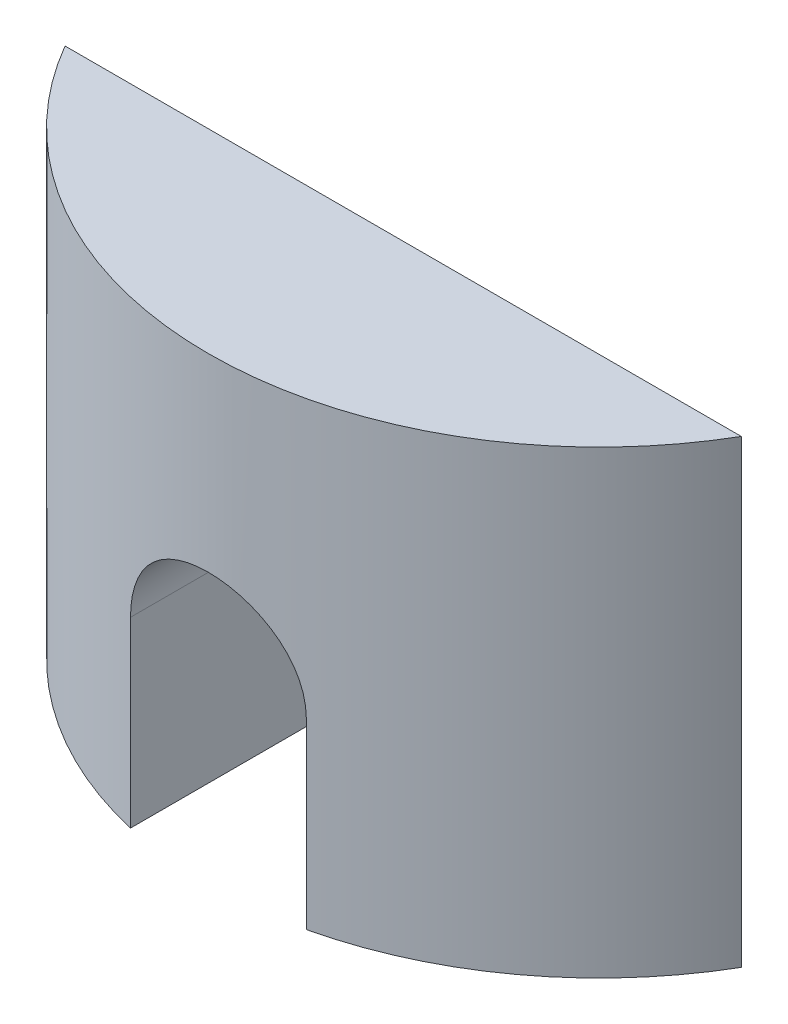
ISO-10303-21;
HEADER;
FILE_DESCRIPTION(('STEP AP214'),'2;1');
FILE_NAME('part.step','',(''),(''),'','','');
FILE_SCHEMA(('AUTOMOTIVE_DESIGN { 1 0 10303 214 1 1 1 1 }'));
ENDSEC;
DATA;
#1=APPLICATION_CONTEXT('core data for automotive mechanical design processes');
#2=APPLICATION_PROTOCOL_DEFINITION('international standard','automotive_design',2000,#1);
#3=PRODUCT_CONTEXT('',#1,'mechanical');
#4=PRODUCT('Part','Part','',(#3));
#5=PRODUCT_RELATED_PRODUCT_CATEGORY('part','',(#4));
#6=PRODUCT_DEFINITION_FORMATION('','',#4);
#7=PRODUCT_DEFINITION_CONTEXT('part definition',#1,'design');
#8=PRODUCT_DEFINITION('design','',#6,#7);
#9=PRODUCT_DEFINITION_SHAPE('','',#8);
#10=(LENGTH_UNIT() NAMED_UNIT(*) SI_UNIT(.MILLI.,.METRE.));
#11=(NAMED_UNIT(*) PLANE_ANGLE_UNIT() SI_UNIT($,.RADIAN.));
#12=(NAMED_UNIT(*) SI_UNIT($,.STERADIAN.) SOLID_ANGLE_UNIT());
#13=UNCERTAINTY_MEASURE_WITH_UNIT(LENGTH_MEASURE(1.E-05),#10,'distance_accuracy_value','');
#14=(GEOMETRIC_REPRESENTATION_CONTEXT(3) GLOBAL_UNCERTAINTY_ASSIGNED_CONTEXT((#13)) GLOBAL_UNIT_ASSIGNED_CONTEXT((#10,
#11,#12)) REPRESENTATION_CONTEXT('',''));
#15=CARTESIAN_POINT('',(0.,0.,0.));
#16=DIRECTION('',(0.,0.,1.));
#17=DIRECTION('',(1.,0.,0.));
#18=AXIS2_PLACEMENT_3D('',#15,#16,#17);
#19=CARTESIAN_POINT('',(12.5,0.,-7.25069444444444));
#20=DIRECTION('',(0.,1.,0.));
#21=DIRECTION('',(0.,0.,1.));
#22=AXIS2_PLACEMENT_3D('',#19,#20,#21);
#23=PLANE('',#22);
#24=CARTESIAN_POINT('',(12.5,0.,-7.25069444444444));
#25=DIRECTION('',(0.,1.,0.));
#26=DIRECTION('',(0.,0.,1.));
#27=AXIS2_PLACEMENT_3D('',#24,#25,#26);
#28=CIRCLE('',#27,14.4506944444444);
#29=CARTESIAN_POINT('',(15.75,0.,6.82979098492544));
#30=VERTEX_POINT('',#29);
#31=CARTESIAN_POINT('',(25.,0.,0.));
#32=VERTEX_POINT('',#31);
#33=EDGE_CURVE('E90',#30,#32,#28,.T.);
#34=ORIENTED_EDGE('',*,*,#33,.F.);
#35=DIRECTION('',(0.,0.,-1.));
#36=VECTOR('',#35,1.);
#37=CARTESIAN_POINT('',(15.75,0.,7.201));
#38=LINE('',#37,#36);
#39=CARTESIAN_POINT('',(15.75,0.,0.));
#40=VERTEX_POINT('',#39);
#41=EDGE_CURVE('E99',#30,#40,#38,.T.);
#42=ORIENTED_EDGE('',*,*,#41,.T.);
#43=DIRECTION('',(-1.,0.,0.));
#44=VECTOR('',#43,1.);
#45=CARTESIAN_POINT('',(0.,0.,0.));
#46=LINE('',#45,#44);
#47=EDGE_CURVE('E80',#32,#40,#46,.T.);
#48=ORIENTED_EDGE('',*,*,#47,.F.);
#49=EDGE_LOOP('',(#34,#42,#48));
#50=FACE_BOUND('',#49,.T.);
#51=ADVANCED_FACE('F33',(#50),#23,.F.);
#52=CARTESIAN_POINT('',(12.5,17.,-7.25069444444444));
#53=DIRECTION('',(0.,-1.,0.));
#54=DIRECTION('',(0.,0.,-1.));
#55=AXIS2_PLACEMENT_3D('',#52,#53,#54);
#56=CYLINDRICAL_SURFACE('',#55,14.4506944444444);
#57=CARTESIAN_POINT('',(15.75,6.75,6.82979098492544));
#58=CARTESIAN_POINT('',(15.7500100979928,6.84017309929072,6.82978207036309));
#59=CARTESIAN_POINT('',(15.7462472773982,6.9303404244272,6.83065700660543));
#60=CARTESIAN_POINT('',(15.7312541741048,7.11000664068488,6.83410852193391));
#61=CARTESIAN_POINT('',(15.7200249703137,7.19950562649325,6.83668485516431));
#62=CARTESIAN_POINT('',(15.6902033190174,7.37705059598649,6.84346725406096));
#63=CARTESIAN_POINT('',(15.671623676813,7.46509883064236,6.84767048521171));
#64=CARTESIAN_POINT('',(15.6272694650283,7.6392531219731,6.85757503872186));
#65=CARTESIAN_POINT('',(15.6014948337241,7.72535916197958,6.86327637393306));
#66=CARTESIAN_POINT('',(15.5136469912468,7.97986478209514,6.88239244625771));
#67=CARTESIAN_POINT('',(15.4410230271039,8.14461010664962,6.89782573593213));
#68=CARTESIAN_POINT('',(15.2698733950116,8.45952617860219,6.93232154504672));
#69=CARTESIAN_POINT('',(15.1713430290809,8.60969427573169,6.95138472257369));
#70=CARTESIAN_POINT('',(14.9492945344272,8.89393886521739,6.99137082736342));
#71=CARTESIAN_POINT('',(14.8254038283357,9.02772136383919,7.0123185156891));
#72=CARTESIAN_POINT('',(14.5569507574089,9.27279613834617,7.05349840878266));
#73=CARTESIAN_POINT('',(14.4123851542332,9.38408488439834,7.07373050084524));
#74=CARTESIAN_POINT('',(14.1046944451549,9.58218943834519,7.11147038493562));
#75=CARTESIAN_POINT('',(13.941380567115,9.66871887743713,7.12894532578534));
#76=CARTESIAN_POINT('',(13.6020791436951,9.81298762681986,7.1589188571177));
#77=CARTESIAN_POINT('',(13.4260937685535,9.87073185377429,7.17141829736814));
#78=CARTESIAN_POINT('',(13.0695226438725,9.95486225849743,7.18985763333379));
#79=CARTESIAN_POINT('',(12.8890609301621,9.98175073883201,7.19590248704781));
#80=CARTESIAN_POINT('',(12.5260894756099,10.0049780316735,7.20111567100761));
#81=CARTESIAN_POINT('',(12.3435799371317,10.0013198366704,7.20028467484272));
#82=CARTESIAN_POINT('',(11.9851689572492,9.96392821389634,7.19191934910496));
#83=CARTESIAN_POINT('',(11.8092077035239,9.9307370675749,7.18450589126792));
#84=CARTESIAN_POINT('',(11.46542009077,9.83608754718759,7.16394699520302));
#85=CARTESIAN_POINT('',(11.2975940474192,9.77462807717007,7.15080133474098));
#86=CARTESIAN_POINT('',(10.973346020124,9.62471373485294,7.12006227004648));
#87=CARTESIAN_POINT('',(10.8170214492242,9.53605529130319,7.10243550343304));
#88=CARTESIAN_POINT('',(10.5212769523391,9.33441409283312,7.0646639028751));
#89=CARTESIAN_POINT('',(10.381858981819,9.22142852835593,7.04451877819639));
#90=CARTESIAN_POINT('',(10.1206685916861,8.97141250937261,7.00340109750861));
#91=CARTESIAN_POINT('',(9.9993488366139,8.83391017490897,6.98242008109273));
#92=CARTESIAN_POINT('',(9.78137238925789,8.54025155056794,6.94240092176995));
#93=CARTESIAN_POINT('',(9.68472244350541,8.38409017504787,6.92336331118473));
#94=CARTESIAN_POINT('',(9.5186066940396,8.05676132394996,6.88935889223175));
#95=CARTESIAN_POINT('',(9.44924627242268,7.88553874036517,6.87440793150892));
#96=CARTESIAN_POINT('',(9.34051457587506,7.53355738961169,6.85048896465696));
#97=CARTESIAN_POINT('',(9.3010986276714,7.35281325987563,6.84151204851896));
#98=CARTESIAN_POINT('',(9.26818349139339,7.1004713933712,6.83397757600851));
#99=CARTESIAN_POINT('',(9.26136283473718,7.03050009053354,6.8324096427533));
#100=CARTESIAN_POINT('',(9.25227654841525,6.89036331191945,6.83031703505251));
#101=CARTESIAN_POINT('',(9.25000338390582,6.8201983505581,6.82979063488283));
#102=CARTESIAN_POINT('',(9.25,6.75,6.82979098492544));
#103=B_SPLINE_CURVE_WITH_KNOTS('',3,(#57,#58,#59,#60,#61,#62,#63,#64,#65,#66,#67,#68,#69,#70,
#71,#72,#73,#74,#75,#76,#77,#78,#79,#80,#81,#82,#83,#84,#85,#86,#87,#88,#89,#90,#91,#92,#93,#94,
#95,#96,#97,#98,#99,#100,#101,#102),.UNSPECIFIED.,.F.,.F.,(4,2,2,2,2,2,2,2,2,2,2,2,2,2,2,2,2,2,
2,2,2,2,4),(0.,0.270426553228011,0.540814037750032,0.810732536213455,1.08065335030381,
1.62001915147565,2.15948283116701,2.70752846132315,3.25566002690402,3.80989634196911,
4.36403795813023,4.90902465440355,5.45395796194915,5.98908712420517,6.52423703495433,
7.06349425919049,7.60281379607268,8.15392991294972,8.70519658421893,9.25857162749959,
9.81111947689677,10.0219589200619,10.2324487282257),.UNSPECIFIED.);
#104=CARTESIAN_POINT('',(15.75,6.75,6.82979098492544));
#105=VERTEX_POINT('',#104);
#106=CARTESIAN_POINT('',(9.25,6.75,6.82979098492544));
#107=VERTEX_POINT('',#106);
#108=EDGE_CURVE('E119',#105,#107,#103,.T.);
#109=ORIENTED_EDGE('',*,*,#108,.F.);
#110=DIRECTION('',(0.,-1.,0.));
#111=VECTOR('',#110,1.);
#112=CARTESIAN_POINT('',(15.75,17.,6.82979098492544));
#113=LINE('',#112,#111);
#114=EDGE_CURVE('E116',#30,#105,#113,.F.);
#115=ORIENTED_EDGE('',*,*,#114,.F.);
#116=ORIENTED_EDGE('',*,*,#33,.T.);
#117=DIRECTION('',(0.,-1.,0.));
#118=VECTOR('',#117,1.);
#119=CARTESIAN_POINT('',(25.,17.,0.));
#120=LINE('',#119,#118);
#121=CARTESIAN_POINT('',(25.,17.,0.));
#122=VERTEX_POINT('',#121);
#123=EDGE_CURVE('E11',#122,#32,#120,.T.);
#124=ORIENTED_EDGE('',*,*,#123,.F.);
#125=CARTESIAN_POINT('',(12.5,17.,-7.25069444444444));
#126=DIRECTION('',(0.,1.,0.));
#127=DIRECTION('',(0.,0.,1.));
#128=AXIS2_PLACEMENT_3D('',#125,#126,#127);
#129=CIRCLE('',#128,14.4506944444444);
#130=CARTESIAN_POINT('',(0.,17.,0.));
#131=VERTEX_POINT('',#130);
#132=EDGE_CURVE('E87',#131,#122,#129,.T.);
#133=ORIENTED_EDGE('',*,*,#132,.F.);
#134=DIRECTION('',(0.,-1.,0.));
#135=VECTOR('',#134,1.);
#136=CARTESIAN_POINT('',(0.,17.,0.));
#137=LINE('',#136,#135);
#138=CARTESIAN_POINT('',(0.,0.,0.));
#139=VERTEX_POINT('',#138);
#140=EDGE_CURVE('E41',#131,#139,#137,.T.);
#141=ORIENTED_EDGE('',*,*,#140,.T.);
#142=CARTESIAN_POINT('',(9.25,0.,6.82979098492544));
#143=VERTEX_POINT('',#142);
#144=EDGE_CURVE('E81',#139,#143,#28,.T.);
#145=ORIENTED_EDGE('',*,*,#144,.T.);
#146=DIRECTION('',(0.,-1.,0.));
#147=VECTOR('',#146,1.);
#148=CARTESIAN_POINT('',(9.25,17.,6.82979098492544));
#149=LINE('',#148,#147);
#150=EDGE_CURVE('E48',#107,#143,#149,.T.);
#151=ORIENTED_EDGE('',*,*,#150,.F.);
#152=EDGE_LOOP('',(#109,#115,#116,#124,#133,#141,#145,#151));
#153=FACE_BOUND('',#152,.T.);
#154=ADVANCED_FACE('F35',(#153),#56,.T.);
#155=CARTESIAN_POINT('',(0.,17.,0.));
#156=DIRECTION('',(0.,0.,1.));
#157=DIRECTION('',(1.,0.,0.));
#158=AXIS2_PLACEMENT_3D('',#155,#156,#157);
#159=PLANE('',#158);
#160=ORIENTED_EDGE('',*,*,#47,.T.);
#161=DIRECTION('',(0.,-1.,0.));
#162=VECTOR('',#161,1.);
#163=CARTESIAN_POINT('',(15.75,0.,0.));
#164=LINE('',#163,#162);
#165=CARTESIAN_POINT('',(15.75,6.75,0.));
#166=VERTEX_POINT('',#165);
#167=EDGE_CURVE('E102',#166,#40,#164,.T.);
#168=ORIENTED_EDGE('',*,*,#167,.F.);
#169=CARTESIAN_POINT('',(12.5,6.75,0.));
#170=DIRECTION('',(0.,0.,-1.));
#171=DIRECTION('',(-1.,0.,0.));
#172=AXIS2_PLACEMENT_3D('',#169,#170,#171);
#173=CIRCLE('',#172,3.25);
#174=CARTESIAN_POINT('',(9.25,6.75,0.));
#175=VERTEX_POINT('',#174);
#176=EDGE_CURVE('E112',#175,#166,#173,.T.);
#177=ORIENTED_EDGE('',*,*,#176,.F.);
#178=DIRECTION('',(0.,1.,0.));
#179=VECTOR('',#178,1.);
#180=CARTESIAN_POINT('',(9.25,6.75,0.));
#181=LINE('',#180,#179);
#182=CARTESIAN_POINT('',(9.25,0.,0.));
#183=VERTEX_POINT('',#182);
#184=EDGE_CURVE('E77',#183,#175,#181,.T.);
#185=ORIENTED_EDGE('',*,*,#184,.F.);
#186=EDGE_CURVE('E69',#183,#139,#46,.T.);
#187=ORIENTED_EDGE('',*,*,#186,.T.);
#188=ORIENTED_EDGE('',*,*,#140,.F.);
#189=DIRECTION('',(-1.,0.,0.));
#190=VECTOR('',#189,1.);
#191=CARTESIAN_POINT('',(0.,17.,0.));
#192=LINE('',#191,#190);
#193=EDGE_CURVE('E56',#122,#131,#192,.T.);
#194=ORIENTED_EDGE('',*,*,#193,.F.);
#195=ORIENTED_EDGE('',*,*,#123,.T.);
#196=EDGE_LOOP('',(#160,#168,#177,#185,#187,#188,#194,#195));
#197=FACE_BOUND('',#196,.T.);
#198=ADVANCED_FACE('F72',(#197),#159,.F.);
#199=CARTESIAN_POINT('',(12.5,17.,-7.25069444444444));
#200=DIRECTION('',(0.,1.,0.));
#201=DIRECTION('',(0.,0.,1.));
#202=AXIS2_PLACEMENT_3D('',#199,#200,#201);
#203=PLANE('',#202);
#204=ORIENTED_EDGE('',*,*,#132,.T.);
#205=ORIENTED_EDGE('',*,*,#193,.T.);
#206=EDGE_LOOP('',(#204,#205));
#207=FACE_BOUND('',#206,.T.);
#208=ADVANCED_FACE('F140',(#207),#203,.T.);
#209=ORIENTED_EDGE('',*,*,#186,.F.);
#210=DIRECTION('',(0.,0.,-1.));
#211=VECTOR('',#210,1.);
#212=CARTESIAN_POINT('',(9.25,0.,7.201));
#213=LINE('',#212,#211);
#214=EDGE_CURVE('E89',#143,#183,#213,.T.);
#215=ORIENTED_EDGE('',*,*,#214,.F.);
#216=ORIENTED_EDGE('',*,*,#144,.F.);
#217=EDGE_LOOP('',(#209,#215,#216));
#218=FACE_BOUND('',#217,.T.);
#219=ADVANCED_FACE('F88',(#218),#23,.F.);
#220=CARTESIAN_POINT('',(15.75,0.,7.201));
#221=DIRECTION('',(1.,0.,0.));
#222=DIRECTION('',(0.,1.,0.));
#223=AXIS2_PLACEMENT_3D('',#220,#221,#222);
#224=PLANE('',#223);
#225=ORIENTED_EDGE('',*,*,#114,.T.);
#226=DIRECTION('',(0.,0.,-1.));
#227=VECTOR('',#226,1.);
#228=CARTESIAN_POINT('',(15.75,6.75,7.201));
#229=LINE('',#228,#227);
#230=EDGE_CURVE('E105',#105,#166,#229,.T.);
#231=ORIENTED_EDGE('',*,*,#230,.T.);
#232=ORIENTED_EDGE('',*,*,#167,.T.);
#233=ORIENTED_EDGE('',*,*,#41,.F.);
#234=EDGE_LOOP('',(#225,#231,#232,#233));
#235=FACE_BOUND('',#234,.T.);
#236=ADVANCED_FACE('F131',(#235),#224,.F.);
#237=CARTESIAN_POINT('',(12.5,6.75,7.201));
#238=DIRECTION('',(0.,0.,-1.));
#239=DIRECTION('',(-1.,0.,0.));
#240=AXIS2_PLACEMENT_3D('',#237,#238,#239);
#241=CYLINDRICAL_SURFACE('',#240,3.25);
#242=ORIENTED_EDGE('',*,*,#108,.T.);
#243=DIRECTION('',(0.,0.,-1.));
#244=VECTOR('',#243,1.);
#245=CARTESIAN_POINT('',(9.25,6.75,7.201));
#246=LINE('',#245,#244);
#247=EDGE_CURVE('E101',#107,#175,#246,.T.);
#248=ORIENTED_EDGE('',*,*,#247,.T.);
#249=ORIENTED_EDGE('',*,*,#176,.T.);
#250=ORIENTED_EDGE('',*,*,#230,.F.);
#251=EDGE_LOOP('',(#242,#248,#249,#250));
#252=FACE_BOUND('',#251,.T.);
#253=ADVANCED_FACE('F126',(#252),#241,.F.);
#254=CARTESIAN_POINT('',(9.25,6.75,7.201));
#255=DIRECTION('',(-1.,0.,0.));
#256=DIRECTION('',(0.,0.,1.));
#257=AXIS2_PLACEMENT_3D('',#254,#255,#256);
#258=PLANE('',#257);
#259=ORIENTED_EDGE('',*,*,#150,.T.);
#260=ORIENTED_EDGE('',*,*,#214,.T.);
#261=ORIENTED_EDGE('',*,*,#184,.T.);
#262=ORIENTED_EDGE('',*,*,#247,.F.);
#263=EDGE_LOOP('',(#259,#260,#261,#262));
#264=FACE_BOUND('',#263,.T.);
#265=ADVANCED_FACE('F138',(#264),#258,.F.);
#266=CLOSED_SHELL('',(#51,#154,#198,#208,#219,#236,#253,#265));
#267=MANIFOLD_SOLID_BREP('B2',#266);
#268=ADVANCED_BREP_SHAPE_REPRESENTATION('',(#18,#267),#14);
#269=SHAPE_DEFINITION_REPRESENTATION(#9,#268);
ENDSEC;
END-ISO-10303-21;
